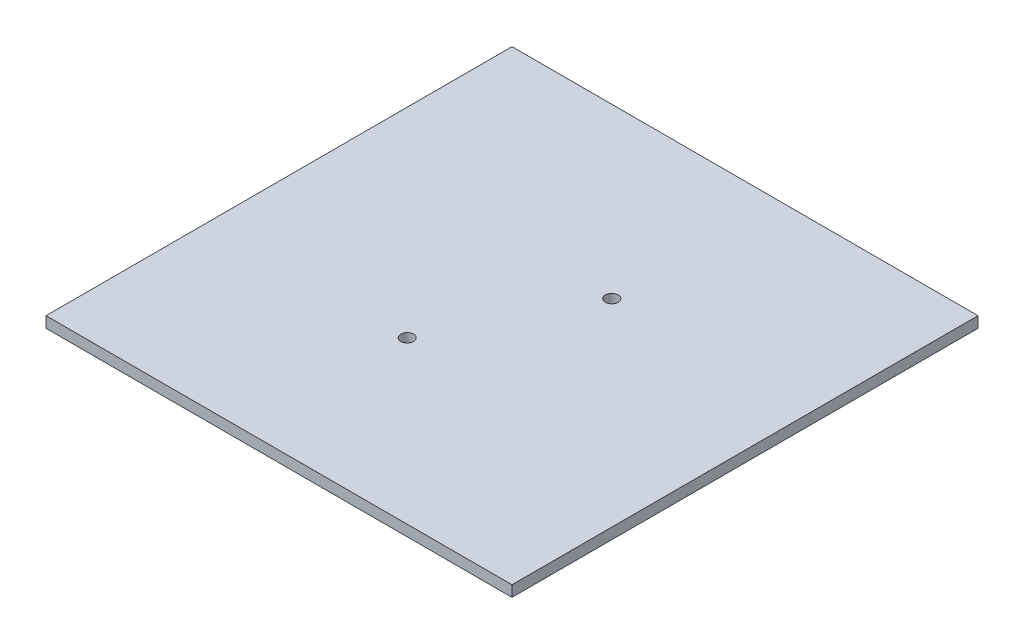
ISO-10303-21;
HEADER;
FILE_DESCRIPTION(('STEP AP214'),'2;1');
FILE_NAME('part.step','',(''),(''),'','','');
FILE_SCHEMA(('AUTOMOTIVE_DESIGN { 1 0 10303 214 1 1 1 1 }'));
ENDSEC;
DATA;
#1=APPLICATION_CONTEXT('core data for automotive mechanical design processes');
#2=APPLICATION_PROTOCOL_DEFINITION('international standard','automotive_design',2000,#1);
#3=PRODUCT_CONTEXT('',#1,'mechanical');
#4=PRODUCT('Part','Part','',(#3));
#5=PRODUCT_RELATED_PRODUCT_CATEGORY('part','',(#4));
#6=PRODUCT_DEFINITION_FORMATION('','',#4);
#7=PRODUCT_DEFINITION_CONTEXT('part definition',#1,'design');
#8=PRODUCT_DEFINITION('design','',#6,#7);
#9=PRODUCT_DEFINITION_SHAPE('','',#8);
#10=(LENGTH_UNIT() NAMED_UNIT(*) SI_UNIT(.MILLI.,.METRE.));
#11=(NAMED_UNIT(*) PLANE_ANGLE_UNIT() SI_UNIT($,.RADIAN.));
#12=(NAMED_UNIT(*) SI_UNIT($,.STERADIAN.) SOLID_ANGLE_UNIT());
#13=UNCERTAINTY_MEASURE_WITH_UNIT(LENGTH_MEASURE(1.E-05),#10,'distance_accuracy_value','');
#14=(GEOMETRIC_REPRESENTATION_CONTEXT(3) GLOBAL_UNCERTAINTY_ASSIGNED_CONTEXT((#13)) GLOBAL_UNIT_ASSIGNED_CONTEXT((#10,
#11,#12)) REPRESENTATION_CONTEXT('',''));
#15=CARTESIAN_POINT('',(0.,0.,0.));
#16=DIRECTION('',(0.,0.,1.));
#17=DIRECTION('',(1.,0.,0.));
#18=AXIS2_PLACEMENT_3D('',#15,#16,#17);
#19=CARTESIAN_POINT('',(0.,59.4097361409451,-50.8));
#20=DIRECTION('',(0.,0.,1.));
#21=DIRECTION('',(1.,0.,0.));
#22=AXIS2_PLACEMENT_3D('',#19,#20,#21);
#23=PLANE('',#22);
#24=DIRECTION('',(1.,0.,0.));
#25=VECTOR('',#24,1.);
#26=CARTESIAN_POINT('',(0.,61.7909861409451,-50.8));
#27=LINE('',#26,#25);
#28=CARTESIAN_POINT('',(-50.8,61.7909861409451,-50.8));
#29=VERTEX_POINT('',#28);
#30=CARTESIAN_POINT('',(50.8,61.7909861409451,-50.8));
#31=VERTEX_POINT('',#30);
#32=EDGE_CURVE('E98',#29,#31,#27,.T.);
#33=ORIENTED_EDGE('',*,*,#32,.T.);
#34=DIRECTION('',(0.,1.,0.));
#35=VECTOR('',#34,1.);
#36=CARTESIAN_POINT('',(50.8,59.4097361409451,-50.8));
#37=LINE('',#36,#35);
#38=CARTESIAN_POINT('',(50.8,59.4097361409451,-50.8));
#39=VERTEX_POINT('',#38);
#40=EDGE_CURVE('E11',#39,#31,#37,.T.);
#41=ORIENTED_EDGE('',*,*,#40,.F.);
#42=DIRECTION('',(1.,0.,0.));
#43=VECTOR('',#42,1.);
#44=CARTESIAN_POINT('',(0.,59.4097361409451,-50.8));
#45=LINE('',#44,#43);
#46=CARTESIAN_POINT('',(-50.8,59.4097361409451,-50.8));
#47=VERTEX_POINT('',#46);
#48=EDGE_CURVE('E84',#47,#39,#45,.T.);
#49=ORIENTED_EDGE('',*,*,#48,.F.);
#50=DIRECTION('',(0.,1.,0.));
#51=VECTOR('',#50,1.);
#52=CARTESIAN_POINT('',(-50.8,59.4097361409451,-50.8));
#53=LINE('',#52,#51);
#54=EDGE_CURVE('E51',#47,#29,#53,.T.);
#55=ORIENTED_EDGE('',*,*,#54,.T.);
#56=EDGE_LOOP('',(#33,#41,#49,#55));
#57=FACE_BOUND('',#56,.T.);
#58=ADVANCED_FACE('F35',(#57),#23,.F.);
#59=CARTESIAN_POINT('',(50.8,59.4097361409451,0.));
#60=DIRECTION('',(-1.,0.,0.));
#61=DIRECTION('',(0.,0.,1.));
#62=AXIS2_PLACEMENT_3D('',#59,#60,#61);
#63=PLANE('',#62);
#64=DIRECTION('',(0.,0.,1.));
#65=VECTOR('',#64,1.);
#66=CARTESIAN_POINT('',(50.8,61.7909861409451,0.));
#67=LINE('',#66,#65);
#68=CARTESIAN_POINT('',(50.8,61.7909861409451,50.8));
#69=VERTEX_POINT('',#68);
#70=EDGE_CURVE('E89',#31,#69,#67,.T.);
#71=ORIENTED_EDGE('',*,*,#70,.T.);
#72=DIRECTION('',(0.,1.,0.));
#73=VECTOR('',#72,1.);
#74=CARTESIAN_POINT('',(50.8,59.4097361409451,50.8));
#75=LINE('',#74,#73);
#76=CARTESIAN_POINT('',(50.8,59.4097361409451,50.8));
#77=VERTEX_POINT('',#76);
#78=EDGE_CURVE('E43',#77,#69,#75,.T.);
#79=ORIENTED_EDGE('',*,*,#78,.F.);
#80=DIRECTION('',(0.,0.,1.));
#81=VECTOR('',#80,1.);
#82=CARTESIAN_POINT('',(50.8,59.4097361409451,0.));
#83=LINE('',#82,#81);
#84=EDGE_CURVE('E76',#39,#77,#83,.T.);
#85=ORIENTED_EDGE('',*,*,#84,.F.);
#86=ORIENTED_EDGE('',*,*,#40,.T.);
#87=EDGE_LOOP('',(#71,#79,#85,#86));
#88=FACE_BOUND('',#87,.T.);
#89=ADVANCED_FACE('F88',(#88),#63,.F.);
#90=CARTESIAN_POINT('',(0.,59.4097361409451,50.8));
#91=DIRECTION('',(0.,0.,1.));
#92=DIRECTION('',(1.,0.,0.));
#93=AXIS2_PLACEMENT_3D('',#90,#91,#92);
#94=PLANE('',#93);
#95=DIRECTION('',(1.,0.,0.));
#96=VECTOR('',#95,1.);
#97=CARTESIAN_POINT('',(0.,61.7909861409451,50.8));
#98=LINE('',#97,#96);
#99=CARTESIAN_POINT('',(-50.8,61.7909861409451,50.8));
#100=VERTEX_POINT('',#99);
#101=EDGE_CURVE('E102',#100,#69,#98,.T.);
#102=ORIENTED_EDGE('',*,*,#101,.F.);
#103=DIRECTION('',(0.,1.,0.));
#104=VECTOR('',#103,1.);
#105=CARTESIAN_POINT('',(-50.8,59.4097361409451,50.8));
#106=LINE('',#105,#104);
#107=CARTESIAN_POINT('',(-50.8,59.4097361409451,50.8));
#108=VERTEX_POINT('',#107);
#109=EDGE_CURVE('E65',#108,#100,#106,.T.);
#110=ORIENTED_EDGE('',*,*,#109,.F.);
#111=DIRECTION('',(1.,0.,0.));
#112=VECTOR('',#111,1.);
#113=CARTESIAN_POINT('',(0.,59.4097361409451,50.8));
#114=LINE('',#113,#112);
#115=EDGE_CURVE('E83',#108,#77,#114,.T.);
#116=ORIENTED_EDGE('',*,*,#115,.T.);
#117=ORIENTED_EDGE('',*,*,#78,.T.);
#118=EDGE_LOOP('',(#102,#110,#116,#117));
#119=FACE_BOUND('',#118,.T.);
#120=ADVANCED_FACE('F92',(#119),#94,.T.);
#121=CARTESIAN_POINT('',(-50.8,59.4097361409451,0.));
#122=DIRECTION('',(-1.,0.,0.));
#123=DIRECTION('',(0.,0.,1.));
#124=AXIS2_PLACEMENT_3D('',#121,#122,#123);
#125=PLANE('',#124);
#126=DIRECTION('',(0.,0.,1.));
#127=VECTOR('',#126,1.);
#128=CARTESIAN_POINT('',(-50.8,61.7909861409451,0.));
#129=LINE('',#128,#127);
#130=EDGE_CURVE('E104',#29,#100,#129,.T.);
#131=ORIENTED_EDGE('',*,*,#130,.F.);
#132=ORIENTED_EDGE('',*,*,#54,.F.);
#133=DIRECTION('',(0.,0.,1.));
#134=VECTOR('',#133,1.);
#135=CARTESIAN_POINT('',(-50.8,59.4097361409451,0.));
#136=LINE('',#135,#134);
#137=EDGE_CURVE('E93',#47,#108,#136,.T.);
#138=ORIENTED_EDGE('',*,*,#137,.T.);
#139=ORIENTED_EDGE('',*,*,#109,.T.);
#140=EDGE_LOOP('',(#131,#132,#138,#139));
#141=FACE_BOUND('',#140,.T.);
#142=ADVANCED_FACE('F127',(#141),#125,.T.);
#143=CARTESIAN_POINT('',(0.,59.4097361409451,0.));
#144=DIRECTION('',(0.,-1.,0.));
#145=DIRECTION('',(0.,0.,-1.));
#146=AXIS2_PLACEMENT_3D('',#143,#144,#145);
#147=PLANE('',#146);
#148=CARTESIAN_POINT('',(-7.25,59.4097361409451,15.6));
#149=DIRECTION('',(0.,-1.,0.));
#150=DIRECTION('',(0.,0.,-1.));
#151=AXIS2_PLACEMENT_3D('',#148,#149,#150);
#152=CIRCLE('',#151,1.397);
#153=CARTESIAN_POINT('',(-7.25,59.4097361409451,14.203));
#154=VERTEX_POINT('',#153);
#155=EDGE_CURVE('E118',#154,#154,#152,.T.);
#156=ORIENTED_EDGE('',*,*,#155,.F.);
#157=EDGE_LOOP('',(#156));
#158=FACE_BOUND('',#157,.T.);
#159=CARTESIAN_POINT('',(7.65,59.4097361409451,-14.1));
#160=DIRECTION('',(0.,-1.,0.));
#161=DIRECTION('',(0.,0.,-1.));
#162=AXIS2_PLACEMENT_3D('',#159,#160,#161);
#163=CIRCLE('',#162,1.397);
#164=CARTESIAN_POINT('',(7.65,59.4097361409451,-15.497));
#165=VERTEX_POINT('',#164);
#166=EDGE_CURVE('E112',#165,#165,#163,.T.);
#167=ORIENTED_EDGE('',*,*,#166,.F.);
#168=EDGE_LOOP('',(#167));
#169=FACE_BOUND('',#168,.T.);
#170=ORIENTED_EDGE('',*,*,#48,.T.);
#171=ORIENTED_EDGE('',*,*,#84,.T.);
#172=ORIENTED_EDGE('',*,*,#115,.F.);
#173=ORIENTED_EDGE('',*,*,#137,.F.);
#174=EDGE_LOOP('',(#170,#171,#172,#173));
#175=FACE_BOUND('',#174,.T.);
#176=ADVANCED_FACE('F80',(#158,#169,#175),#147,.T.);
#177=CARTESIAN_POINT('',(0.,61.7909861409451,0.));
#178=DIRECTION('',(0.,-1.,0.));
#179=DIRECTION('',(0.,0.,-1.));
#180=AXIS2_PLACEMENT_3D('',#177,#178,#179);
#181=PLANE('',#180);
#182=CARTESIAN_POINT('',(-7.25,61.7909861409451,15.6));
#183=DIRECTION('',(0.,-1.,0.));
#184=DIRECTION('',(0.,0.,-1.));
#185=AXIS2_PLACEMENT_3D('',#182,#183,#184);
#186=CIRCLE('',#185,1.397);
#187=CARTESIAN_POINT('',(-7.25,61.7909861409451,14.203));
#188=VERTEX_POINT('',#187);
#189=EDGE_CURVE('E115',#188,#188,#186,.T.);
#190=ORIENTED_EDGE('',*,*,#189,.T.);
#191=EDGE_LOOP('',(#190));
#192=FACE_BOUND('',#191,.T.);
#193=CARTESIAN_POINT('',(7.65,61.7909861409451,-14.1));
#194=DIRECTION('',(0.,-1.,0.));
#195=DIRECTION('',(0.,0.,-1.));
#196=AXIS2_PLACEMENT_3D('',#193,#194,#195);
#197=CIRCLE('',#196,1.397);
#198=CARTESIAN_POINT('',(7.65,61.7909861409451,-15.497));
#199=VERTEX_POINT('',#198);
#200=EDGE_CURVE('E100',#199,#199,#197,.T.);
#201=ORIENTED_EDGE('',*,*,#200,.T.);
#202=EDGE_LOOP('',(#201));
#203=FACE_BOUND('',#202,.T.);
#204=ORIENTED_EDGE('',*,*,#32,.F.);
#205=ORIENTED_EDGE('',*,*,#130,.T.);
#206=ORIENTED_EDGE('',*,*,#101,.T.);
#207=ORIENTED_EDGE('',*,*,#70,.F.);
#208=EDGE_LOOP('',(#204,#205,#206,#207));
#209=FACE_BOUND('',#208,.T.);
#210=ADVANCED_FACE('F126',(#192,#203,#209),#181,.F.);
#211=CARTESIAN_POINT('',(7.65,59.4097361409451,-14.1));
#212=DIRECTION('',(0.,-1.,0.));
#213=DIRECTION('',(0.,0.,-1.));
#214=AXIS2_PLACEMENT_3D('',#211,#212,#213);
#215=CYLINDRICAL_SURFACE('',#214,1.397);
#216=ORIENTED_EDGE('',*,*,#200,.F.);
#217=EDGE_LOOP('',(#216));
#218=FACE_BOUND('',#217,.T.);
#219=ORIENTED_EDGE('',*,*,#166,.T.);
#220=EDGE_LOOP('',(#219));
#221=FACE_BOUND('',#220,.T.);
#222=ADVANCED_FACE('F131',(#218,#221),#215,.F.);
#223=CARTESIAN_POINT('',(-7.25,59.4097361409451,15.6));
#224=DIRECTION('',(0.,-1.,0.));
#225=DIRECTION('',(0.,0.,-1.));
#226=AXIS2_PLACEMENT_3D('',#223,#224,#225);
#227=CYLINDRICAL_SURFACE('',#226,1.397);
#228=ORIENTED_EDGE('',*,*,#189,.F.);
#229=EDGE_LOOP('',(#228));
#230=FACE_BOUND('',#229,.T.);
#231=ORIENTED_EDGE('',*,*,#155,.T.);
#232=EDGE_LOOP('',(#231));
#233=FACE_BOUND('',#232,.T.);
#234=ADVANCED_FACE('F122',(#230,#233),#227,.F.);
#235=CLOSED_SHELL('',(#58,#89,#120,#142,#176,#210,#222,#234));
#236=MANIFOLD_SOLID_BREP('B2',#235);
#237=ADVANCED_BREP_SHAPE_REPRESENTATION('',(#18,#236),#14);
#238=SHAPE_DEFINITION_REPRESENTATION(#9,#237);
ENDSEC;
END-ISO-10303-21;
